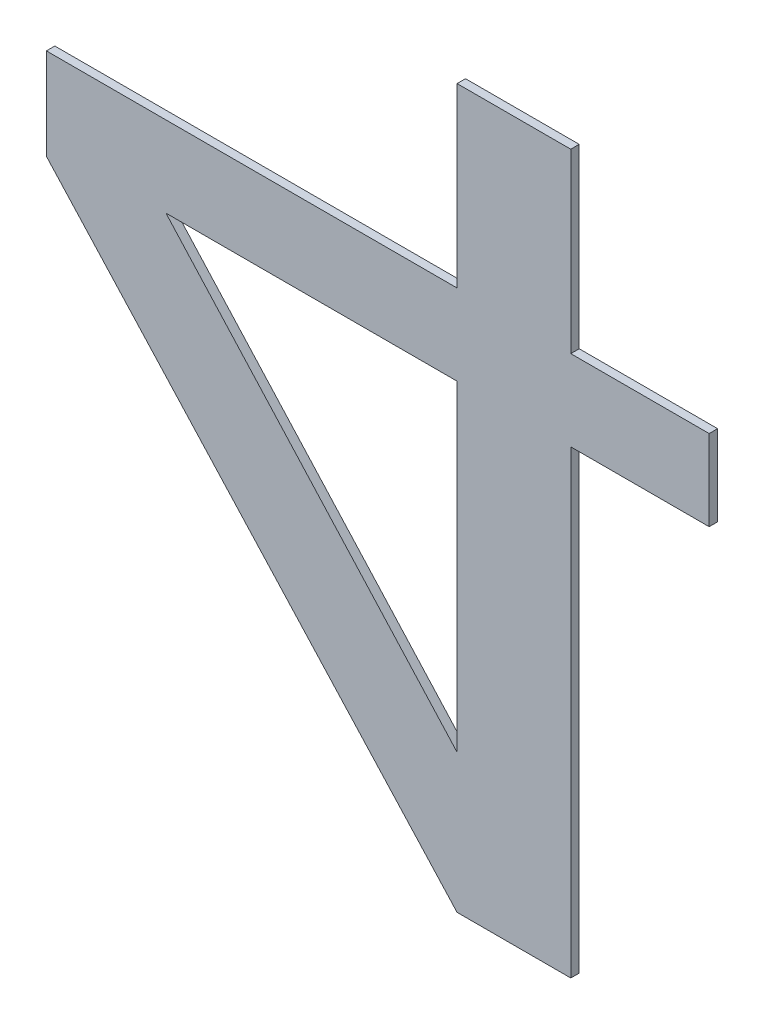
ISO-10303-21;
HEADER;
FILE_DESCRIPTION(('STEP AP214'),'2;1');
FILE_NAME('part.step','',(''),(''),'','','');
FILE_SCHEMA(('AUTOMOTIVE_DESIGN { 1 0 10303 214 1 1 1 1 }'));
ENDSEC;
DATA;
#1=APPLICATION_CONTEXT('core data for automotive mechanical design processes');
#2=APPLICATION_PROTOCOL_DEFINITION('international standard','automotive_design',2000,#1);
#3=PRODUCT_CONTEXT('',#1,'mechanical');
#4=PRODUCT('Part','Part','',(#3));
#5=PRODUCT_RELATED_PRODUCT_CATEGORY('part','',(#4));
#6=PRODUCT_DEFINITION_FORMATION('','',#4);
#7=PRODUCT_DEFINITION_CONTEXT('part definition',#1,'design');
#8=PRODUCT_DEFINITION('design','',#6,#7);
#9=PRODUCT_DEFINITION_SHAPE('','',#8);
#10=(LENGTH_UNIT() NAMED_UNIT(*) SI_UNIT(.MILLI.,.METRE.));
#11=(NAMED_UNIT(*) PLANE_ANGLE_UNIT() SI_UNIT($,.RADIAN.));
#12=(NAMED_UNIT(*) SI_UNIT($,.STERADIAN.) SOLID_ANGLE_UNIT());
#13=UNCERTAINTY_MEASURE_WITH_UNIT(LENGTH_MEASURE(1.E-05),#10,'distance_accuracy_value','');
#14=(GEOMETRIC_REPRESENTATION_CONTEXT(3) GLOBAL_UNCERTAINTY_ASSIGNED_CONTEXT((#13)) GLOBAL_UNIT_ASSIGNED_CONTEXT((#10,
#11,#12)) REPRESENTATION_CONTEXT('',''));
#15=CARTESIAN_POINT('',(0.,0.,0.));
#16=DIRECTION('',(0.,0.,1.));
#17=DIRECTION('',(1.,0.,0.));
#18=AXIS2_PLACEMENT_3D('',#15,#16,#17);
#19=CARTESIAN_POINT('',(-0.0269561142830154,0.0653781223592418,-3.5306));
#20=DIRECTION('',(0.,0.,1.));
#21=DIRECTION('',(1.,0.,0.));
#22=AXIS2_PLACEMENT_3D('',#19,#20,#21);
#23=PLANE('',#22);
#24=DIRECTION('',(1.,0.,0.));
#25=VECTOR('',#24,1.);
#26=CARTESIAN_POINT('',(-0.0768047949656172,0.14144017505025,-3.5306));
#27=LINE('',#26,#25);
#28=CARTESIAN_POINT('',(-0.186276473068739,0.141440175050248,-3.5306));
#29=VERTEX_POINT('',#28);
#30=CARTESIAN_POINT('',(0.0326668831375026,0.14144017505025,-3.5306));
#31=VERTEX_POINT('',#30);
#32=EDGE_CURVE('E186',#29,#31,#27,.T.);
#33=ORIENTED_EDGE('',*,*,#32,.T.);
#34=DIRECTION('',(0.,1.,0.));
#35=VECTOR('',#34,1.);
#36=CARTESIAN_POINT('',(0.0326668831375026,0.0206134295401527,-3.5306));
#37=LINE('',#36,#35);
#38=CARTESIAN_POINT('',(0.0326668831375032,-0.100213315969944,-3.5306));
#39=VERTEX_POINT('',#38);
#40=EDGE_CURVE('E179',#31,#39,#37,.F.);
#41=ORIENTED_EDGE('',*,*,#40,.T.);
#42=DIRECTION('',(-0.671426608920731,0.741071055185134,0.));
#43=VECTOR('',#42,1.);
#44=CARTESIAN_POINT('',(-0.0768047949656172,0.0206134295401476,-3.5306));
#45=LINE('',#44,#43);
#46=EDGE_CURVE('E183',#29,#39,#45,.F.);
#47=ORIENTED_EDGE('',*,*,#46,.F.);
#48=EDGE_LOOP('',(#33,#41,#47));
#49=FACE_BOUND('',#48,.T.);
#50=DIRECTION('',(0.,1.,0.));
#51=VECTOR('',#50,1.);
#52=CARTESIAN_POINT('',(0.222287374945519,0.171789124274023,-3.5306));
#53=LINE('',#52,#51);
#54=CARTESIAN_POINT('',(0.222287374945519,0.202138073497771,-3.5306));
#55=VERTEX_POINT('',#54);
#56=CARTESIAN_POINT('',(0.222287374945519,0.14144017505025,-3.5306));
#57=VERTEX_POINT('',#56);
#58=EDGE_CURVE('E117',#55,#57,#53,.F.);
#59=ORIENTED_EDGE('',*,*,#58,.F.);
#60=DIRECTION('',(1.,0.,0.));
#61=VECTOR('',#60,1.);
#62=CARTESIAN_POINT('',(0.170239496596196,0.202138073497771,-3.5306));
#63=LINE('',#62,#61);
#64=CARTESIAN_POINT('',(0.118191618246872,0.202138073497771,-3.5306));
#65=VERTEX_POINT('',#64);
#66=EDGE_CURVE('E18',#65,#55,#63,.T.);
#67=ORIENTED_EDGE('',*,*,#66,.F.);
#68=DIRECTION('',(0.,1.,0.));
#69=VECTOR('',#68,1.);
#70=CARTESIAN_POINT('',(0.118191618246872,0.268716077995014,-3.5306));
#71=LINE('',#70,#69);
#72=CARTESIAN_POINT('',(0.118191618246872,0.335294082492282,-3.5306));
#73=VERTEX_POINT('',#72);
#74=EDGE_CURVE('E113',#73,#65,#71,.F.);
#75=ORIENTED_EDGE('',*,*,#74,.F.);
#76=DIRECTION('',(1.,0.,0.));
#77=VECTOR('',#76,1.);
#78=CARTESIAN_POINT('',(0.0754292506921748,0.335294082492282,-3.5306));
#79=LINE('',#78,#77);
#80=CARTESIAN_POINT('',(0.0326668831375026,0.335294082492282,-3.5306));
#81=VERTEX_POINT('',#80);
#82=EDGE_CURVE('E135',#81,#73,#79,.T.);
#83=ORIENTED_EDGE('',*,*,#82,.F.);
#84=DIRECTION('',(0.,1.,0.));
#85=VECTOR('',#84,1.);
#86=CARTESIAN_POINT('',(0.0326668831375026,0.268716077995014,-3.5306));
#87=LINE('',#86,#85);
#88=CARTESIAN_POINT('',(0.0326668831375026,0.202138073497771,-3.5306));
#89=VERTEX_POINT('',#88);
#90=EDGE_CURVE('E137',#81,#89,#87,.F.);
#91=ORIENTED_EDGE('',*,*,#90,.T.);
#92=DIRECTION('',(1.,0.,0.));
#93=VECTOR('',#92,1.);
#94=CARTESIAN_POINT('',(-0.121766360187011,0.202138073497771,-3.5306));
#95=LINE('',#94,#93);
#96=CARTESIAN_POINT('',(-0.27619960351155,0.202138073497771,-3.5306));
#97=VERTEX_POINT('',#96);
#98=EDGE_CURVE('E144',#97,#89,#95,.T.);
#99=ORIENTED_EDGE('',*,*,#98,.F.);
#100=DIRECTION('',(0.,1.,0.));
#101=VECTOR('',#100,1.);
#102=CARTESIAN_POINT('',(-0.27619960351155,0.167805822866906,-3.5306));
#103=LINE('',#102,#101);
#104=CARTESIAN_POINT('',(-0.276199603511545,0.133473572236064,-3.5306));
#105=VERTEX_POINT('',#104);
#106=EDGE_CURVE('E147',#97,#105,#103,.F.);
#107=ORIENTED_EDGE('',*,*,#106,.T.);
#108=DIRECTION('',(-0.674563948422604,0.738216417785805,0.));
#109=VECTOR('',#108,1.);
#110=CARTESIAN_POINT('',(-0.121766360187011,-0.0355321327688664,-3.5306));
#111=LINE('',#110,#109);
#112=CARTESIAN_POINT('',(0.0326668831375038,-0.204537837773797,-3.5306));
#113=VERTEX_POINT('',#112);
#114=EDGE_CURVE('E153',#105,#113,#111,.F.);
#115=ORIENTED_EDGE('',*,*,#114,.T.);
#116=DIRECTION('',(1.,0.,0.));
#117=VECTOR('',#116,1.);
#118=CARTESIAN_POINT('',(0.0754292506921748,-0.204537837773798,-3.5306));
#119=LINE('',#118,#117);
#120=CARTESIAN_POINT('',(0.118191618246872,-0.204537837773798,-3.5306));
#121=VERTEX_POINT('',#120);
#122=EDGE_CURVE('E159',#113,#121,#119,.T.);
#123=ORIENTED_EDGE('',*,*,#122,.T.);
#124=DIRECTION('',(0.,1.,0.));
#125=VECTOR('',#124,1.);
#126=CARTESIAN_POINT('',(0.118191618246872,-0.0315488313617742,-3.5306));
#127=LINE('',#126,#125);
#128=CARTESIAN_POINT('',(0.118191618246872,0.14144017505025,-3.5306));
#129=VERTEX_POINT('',#128);
#130=EDGE_CURVE('E166',#129,#121,#127,.F.);
#131=ORIENTED_EDGE('',*,*,#130,.F.);
#132=DIRECTION('',(1.,0.,0.));
#133=VECTOR('',#132,1.);
#134=CARTESIAN_POINT('',(0.170239496596196,0.14144017505025,-3.5306));
#135=LINE('',#134,#133);
#136=EDGE_CURVE('E169',#129,#57,#135,.T.);
#137=ORIENTED_EDGE('',*,*,#136,.T.);
#138=EDGE_LOOP('',(#59,#67,#75,#83,#91,#99,#107,#115,#123,#131,#137));
#139=FACE_BOUND('',#138,.T.);
#140=ADVANCED_FACE('F15',(#49,#139),#23,.T.);
#141=CARTESIAN_POINT('',(0.170239496596196,0.202138073497771,-3.533775));
#142=DIRECTION('',(0.,1.,0.));
#143=DIRECTION('',(0.,0.,1.));
#144=AXIS2_PLACEMENT_3D('',#141,#142,#143);
#145=PLANE('',#144);
#146=DIRECTION('',(0.,0.,-1.));
#147=VECTOR('',#146,1.);
#148=CARTESIAN_POINT('',(0.118191618246872,0.202138073497771,-3.533775));
#149=LINE('',#148,#147);
#150=CARTESIAN_POINT('',(0.118191618246872,0.202138073497771,-3.53695));
#151=VERTEX_POINT('',#150);
#152=EDGE_CURVE('E122',#65,#151,#149,.T.);
#153=ORIENTED_EDGE('',*,*,#152,.F.);
#154=ORIENTED_EDGE('',*,*,#66,.T.);
#155=DIRECTION('',(0.,0.,-1.));
#156=VECTOR('',#155,1.);
#157=CARTESIAN_POINT('',(0.222287374945519,0.202138073497771,-3.533775));
#158=LINE('',#157,#156);
#159=CARTESIAN_POINT('',(0.222287374945519,0.202138073497771,-3.53695));
#160=VERTEX_POINT('',#159);
#161=EDGE_CURVE('E176',#160,#55,#158,.F.);
#162=ORIENTED_EDGE('',*,*,#161,.F.);
#163=DIRECTION('',(1.,0.,0.));
#164=VECTOR('',#163,1.);
#165=CARTESIAN_POINT('',(-0.0269561142830154,0.202138073497771,-3.53695));
#166=LINE('',#165,#164);
#167=EDGE_CURVE('E132',#160,#151,#166,.F.);
#168=ORIENTED_EDGE('',*,*,#167,.T.);
#169=EDGE_LOOP('',(#153,#154,#162,#168));
#170=FACE_BOUND('',#169,.T.);
#171=ADVANCED_FACE('F131',(#170),#145,.T.);
#172=CARTESIAN_POINT('',(0.118191618246872,0.268716077995014,-3.533775));
#173=DIRECTION('',(1.,0.,0.));
#174=DIRECTION('',(0.,0.,-1.));
#175=AXIS2_PLACEMENT_3D('',#172,#173,#174);
#176=PLANE('',#175);
#177=DIRECTION('',(0.,0.,1.));
#178=VECTOR('',#177,1.);
#179=CARTESIAN_POINT('',(0.118191618246872,0.335294082492282,-3.533775));
#180=LINE('',#179,#178);
#181=CARTESIAN_POINT('',(0.118191618246872,0.335294082492282,-3.53695));
#182=VERTEX_POINT('',#181);
#183=EDGE_CURVE('E128',#73,#182,#180,.F.);
#184=ORIENTED_EDGE('',*,*,#183,.F.);
#185=ORIENTED_EDGE('',*,*,#74,.T.);
#186=ORIENTED_EDGE('',*,*,#152,.T.);
#187=DIRECTION('',(0.,1.,0.));
#188=VECTOR('',#187,1.);
#189=CARTESIAN_POINT('',(0.118191618246872,0.0653781223592418,-3.53695));
#190=LINE('',#189,#188);
#191=EDGE_CURVE('E194',#151,#182,#190,.T.);
#192=ORIENTED_EDGE('',*,*,#191,.T.);
#193=EDGE_LOOP('',(#184,#185,#186,#192));
#194=FACE_BOUND('',#193,.T.);
#195=ADVANCED_FACE('F125',(#194),#176,.T.);
#196=CARTESIAN_POINT('',(0.0754292506921748,0.335294082492282,-3.533775));
#197=DIRECTION('',(0.,1.,0.));
#198=DIRECTION('',(0.,0.,1.));
#199=AXIS2_PLACEMENT_3D('',#196,#197,#198);
#200=PLANE('',#199);
#201=DIRECTION('',(0.,0.,-1.));
#202=VECTOR('',#201,1.);
#203=CARTESIAN_POINT('',(0.0326668831375026,0.335294082492282,-3.533775));
#204=LINE('',#203,#202);
#205=CARTESIAN_POINT('',(0.0326668831375026,0.335294082492282,-3.53695));
#206=VERTEX_POINT('',#205);
#207=EDGE_CURVE('E139',#206,#81,#204,.F.);
#208=ORIENTED_EDGE('',*,*,#207,.T.);
#209=ORIENTED_EDGE('',*,*,#82,.T.);
#210=ORIENTED_EDGE('',*,*,#183,.T.);
#211=DIRECTION('',(1.,0.,0.));
#212=VECTOR('',#211,1.);
#213=CARTESIAN_POINT('',(-0.0269561142830154,0.335294082492282,-3.53695));
#214=LINE('',#213,#212);
#215=EDGE_CURVE('E196',#182,#206,#214,.F.);
#216=ORIENTED_EDGE('',*,*,#215,.T.);
#217=EDGE_LOOP('',(#208,#209,#210,#216));
#218=FACE_BOUND('',#217,.T.);
#219=ADVANCED_FACE('F281',(#218),#200,.T.);
#220=CARTESIAN_POINT('',(0.0326668831375026,0.268716077995014,-3.533775));
#221=DIRECTION('',(1.,0.,0.));
#222=DIRECTION('',(0.,0.,-1.));
#223=AXIS2_PLACEMENT_3D('',#220,#221,#222);
#224=PLANE('',#223);
#225=DIRECTION('',(0.,1.,0.));
#226=VECTOR('',#225,1.);
#227=CARTESIAN_POINT('',(0.0326668831375026,0.0653781223592418,-3.53695));
#228=LINE('',#227,#226);
#229=CARTESIAN_POINT('',(0.0326668831375026,0.202138073497771,-3.53695));
#230=VERTEX_POINT('',#229);
#231=EDGE_CURVE('E199',#206,#230,#228,.F.);
#232=ORIENTED_EDGE('',*,*,#231,.T.);
#233=DIRECTION('',(0.,0.,1.));
#234=VECTOR('',#233,1.);
#235=CARTESIAN_POINT('',(0.0326668831375026,0.202138073497771,-3.533775));
#236=LINE('',#235,#234);
#237=EDGE_CURVE('E142',#89,#230,#236,.F.);
#238=ORIENTED_EDGE('',*,*,#237,.F.);
#239=ORIENTED_EDGE('',*,*,#90,.F.);
#240=ORIENTED_EDGE('',*,*,#207,.F.);
#241=EDGE_LOOP('',(#232,#238,#239,#240));
#242=FACE_BOUND('',#241,.T.);
#243=ADVANCED_FACE('F277',(#242),#224,.F.);
#244=CARTESIAN_POINT('',(-0.121766360187011,0.202138073497771,-3.533775));
#245=DIRECTION('',(0.,1.,0.));
#246=DIRECTION('',(0.,0.,1.));
#247=AXIS2_PLACEMENT_3D('',#244,#245,#246);
#248=PLANE('',#247);
#249=DIRECTION('',(0.,0.,-1.));
#250=VECTOR('',#249,1.);
#251=CARTESIAN_POINT('',(-0.27619960351155,0.202138073497771,-3.533775));
#252=LINE('',#251,#250);
#253=CARTESIAN_POINT('',(-0.27619960351155,0.202138073497771,-3.53695));
#254=VERTEX_POINT('',#253);
#255=EDGE_CURVE('E150',#254,#97,#252,.F.);
#256=ORIENTED_EDGE('',*,*,#255,.T.);
#257=ORIENTED_EDGE('',*,*,#98,.T.);
#258=ORIENTED_EDGE('',*,*,#237,.T.);
#259=DIRECTION('',(1.,0.,0.));
#260=VECTOR('',#259,1.);
#261=CARTESIAN_POINT('',(-0.0269561142830154,0.202138073497771,-3.53695));
#262=LINE('',#261,#260);
#263=EDGE_CURVE('E202',#230,#254,#262,.F.);
#264=ORIENTED_EDGE('',*,*,#263,.T.);
#265=EDGE_LOOP('',(#256,#257,#258,#264));
#266=FACE_BOUND('',#265,.T.);
#267=ADVANCED_FACE('F273',(#266),#248,.T.);
#268=CARTESIAN_POINT('',(-0.27619960351155,0.167805822866906,-3.533775));
#269=DIRECTION('',(1.,0.,0.));
#270=DIRECTION('',(0.,0.,-1.));
#271=AXIS2_PLACEMENT_3D('',#268,#269,#270);
#272=PLANE('',#271);
#273=DIRECTION('',(0.,1.,0.));
#274=VECTOR('',#273,1.);
#275=CARTESIAN_POINT('',(-0.27619960351155,0.0653781223592418,-3.53695));
#276=LINE('',#275,#274);
#277=CARTESIAN_POINT('',(-0.276199603511545,0.133473572236058,-3.53695));
#278=VERTEX_POINT('',#277);
#279=EDGE_CURVE('E205',#254,#278,#276,.F.);
#280=ORIENTED_EDGE('',*,*,#279,.T.);
#281=DIRECTION('',(0.,0.,1.));
#282=VECTOR('',#281,1.);
#283=CARTESIAN_POINT('',(-0.276199603511529,0.13347357223606,-3.533775));
#284=LINE('',#283,#282);
#285=EDGE_CURVE('E156',#278,#105,#284,.T.);
#286=ORIENTED_EDGE('',*,*,#285,.T.);
#287=ORIENTED_EDGE('',*,*,#106,.F.);
#288=ORIENTED_EDGE('',*,*,#255,.F.);
#289=EDGE_LOOP('',(#280,#286,#287,#288));
#290=FACE_BOUND('',#289,.T.);
#291=ADVANCED_FACE('F269',(#290),#272,.F.);
#292=CARTESIAN_POINT('',(-0.121766360187011,-0.0355321327688664,-3.533775));
#293=DIRECTION('',(0.738216417785805,0.674563948422604,0.));
#294=DIRECTION('',(-0.674563948422604,0.738216417785805,0.));
#295=AXIS2_PLACEMENT_3D('',#292,#293,#294);
#296=PLANE('',#295);
#297=DIRECTION('',(0.67456394842264,-0.738216417785772,0.));
#298=VECTOR('',#297,1.);
#299=CARTESIAN_POINT('',(-0.27619960351155,0.13347357223604,-3.53695));
#300=LINE('',#299,#298);
#301=CARTESIAN_POINT('',(0.0326668831375051,-0.204537837773796,-3.53695));
#302=VERTEX_POINT('',#301);
#303=EDGE_CURVE('E208',#278,#302,#300,.T.);
#304=ORIENTED_EDGE('',*,*,#303,.T.);
#305=DIRECTION('',(0.,0.,1.));
#306=VECTOR('',#305,1.);
#307=CARTESIAN_POINT('',(0.0326668831375026,-0.204537837773798,-3.533775));
#308=LINE('',#307,#306);
#309=EDGE_CURVE('E161',#302,#113,#308,.T.);
#310=ORIENTED_EDGE('',*,*,#309,.T.);
#311=ORIENTED_EDGE('',*,*,#114,.F.);
#312=ORIENTED_EDGE('',*,*,#285,.F.);
#313=EDGE_LOOP('',(#304,#310,#311,#312));
#314=FACE_BOUND('',#313,.T.);
#315=ADVANCED_FACE('F265',(#314),#296,.F.);
#316=CARTESIAN_POINT('',(0.0754292506921748,-0.204537837773798,-3.533775));
#317=DIRECTION('',(0.,1.,0.));
#318=DIRECTION('',(0.,0.,1.));
#319=AXIS2_PLACEMENT_3D('',#316,#317,#318);
#320=PLANE('',#319);
#321=DIRECTION('',(1.,0.,0.));
#322=VECTOR('',#321,1.);
#323=CARTESIAN_POINT('',(-0.0269561142830154,-0.204537837773798,-3.53695));
#324=LINE('',#323,#322);
#325=CARTESIAN_POINT('',(0.118191618246872,-0.204537837773798,-3.53695));
#326=VERTEX_POINT('',#325);
#327=EDGE_CURVE('E211',#302,#326,#324,.T.);
#328=ORIENTED_EDGE('',*,*,#327,.T.);
#329=DIRECTION('',(0.,0.,-1.));
#330=VECTOR('',#329,1.);
#331=CARTESIAN_POINT('',(0.118191618246872,-0.204537837773798,-3.533775));
#332=LINE('',#331,#330);
#333=EDGE_CURVE('E164',#121,#326,#332,.T.);
#334=ORIENTED_EDGE('',*,*,#333,.F.);
#335=ORIENTED_EDGE('',*,*,#122,.F.);
#336=ORIENTED_EDGE('',*,*,#309,.F.);
#337=EDGE_LOOP('',(#328,#334,#335,#336));
#338=FACE_BOUND('',#337,.T.);
#339=ADVANCED_FACE('F261',(#338),#320,.F.);
#340=CARTESIAN_POINT('',(0.118191618246872,-0.0315488313617742,-3.533775));
#341=DIRECTION('',(1.,0.,0.));
#342=DIRECTION('',(0.,0.,-1.));
#343=AXIS2_PLACEMENT_3D('',#340,#341,#342);
#344=PLANE('',#343);
#345=DIRECTION('',(0.,0.,1.));
#346=VECTOR('',#345,1.);
#347=CARTESIAN_POINT('',(0.118191618246872,0.14144017505025,-3.533775));
#348=LINE('',#347,#346);
#349=CARTESIAN_POINT('',(0.118191618246872,0.14144017505025,-3.53695));
#350=VERTEX_POINT('',#349);
#351=EDGE_CURVE('E171',#350,#129,#348,.T.);
#352=ORIENTED_EDGE('',*,*,#351,.T.);
#353=ORIENTED_EDGE('',*,*,#130,.T.);
#354=ORIENTED_EDGE('',*,*,#333,.T.);
#355=DIRECTION('',(0.,1.,0.));
#356=VECTOR('',#355,1.);
#357=CARTESIAN_POINT('',(0.118191618246872,0.0653781223592418,-3.53695));
#358=LINE('',#357,#356);
#359=EDGE_CURVE('E214',#326,#350,#358,.T.);
#360=ORIENTED_EDGE('',*,*,#359,.T.);
#361=EDGE_LOOP('',(#352,#353,#354,#360));
#362=FACE_BOUND('',#361,.T.);
#363=ADVANCED_FACE('F257',(#362),#344,.T.);
#364=CARTESIAN_POINT('',(0.170239496596196,0.14144017505025,-3.533775));
#365=DIRECTION('',(0.,1.,0.));
#366=DIRECTION('',(0.,0.,1.));
#367=AXIS2_PLACEMENT_3D('',#364,#365,#366);
#368=PLANE('',#367);
#369=DIRECTION('',(1.,0.,0.));
#370=VECTOR('',#369,1.);
#371=CARTESIAN_POINT('',(-0.0269561142830154,0.14144017505025,-3.53695));
#372=LINE('',#371,#370);
#373=CARTESIAN_POINT('',(0.222287374945519,0.14144017505025,-3.53695));
#374=VERTEX_POINT('',#373);
#375=EDGE_CURVE('E217',#350,#374,#372,.T.);
#376=ORIENTED_EDGE('',*,*,#375,.T.);
#377=DIRECTION('',(0.,0.,-1.));
#378=VECTOR('',#377,1.);
#379=CARTESIAN_POINT('',(0.222287374945519,0.14144017505025,-3.533775));
#380=LINE('',#379,#378);
#381=EDGE_CURVE('E174',#57,#374,#380,.T.);
#382=ORIENTED_EDGE('',*,*,#381,.F.);
#383=ORIENTED_EDGE('',*,*,#136,.F.);
#384=ORIENTED_EDGE('',*,*,#351,.F.);
#385=EDGE_LOOP('',(#376,#382,#383,#384));
#386=FACE_BOUND('',#385,.T.);
#387=ADVANCED_FACE('F253',(#386),#368,.F.);
#388=CARTESIAN_POINT('',(0.222287374945519,0.171789124274023,-3.533775));
#389=DIRECTION('',(1.,0.,0.));
#390=DIRECTION('',(0.,0.,-1.));
#391=AXIS2_PLACEMENT_3D('',#388,#389,#390);
#392=PLANE('',#391);
#393=ORIENTED_EDGE('',*,*,#161,.T.);
#394=ORIENTED_EDGE('',*,*,#58,.T.);
#395=ORIENTED_EDGE('',*,*,#381,.T.);
#396=DIRECTION('',(0.,1.,0.));
#397=VECTOR('',#396,1.);
#398=CARTESIAN_POINT('',(0.222287374945519,0.0653781223592418,-3.53695));
#399=LINE('',#398,#397);
#400=EDGE_CURVE('E220',#374,#160,#399,.T.);
#401=ORIENTED_EDGE('',*,*,#400,.T.);
#402=EDGE_LOOP('',(#393,#394,#395,#401));
#403=FACE_BOUND('',#402,.T.);
#404=ADVANCED_FACE('F250',(#403),#392,.T.);
#405=CARTESIAN_POINT('',(0.0326668831375026,0.0206134295401527,-3.533775));
#406=DIRECTION('',(1.,0.,0.));
#407=DIRECTION('',(0.,0.,-1.));
#408=AXIS2_PLACEMENT_3D('',#405,#406,#407);
#409=PLANE('',#408);
#410=DIRECTION('',(0.,1.,0.));
#411=VECTOR('',#410,1.);
#412=CARTESIAN_POINT('',(0.0326668831375026,0.0653781223592418,-3.53695));
#413=LINE('',#412,#411);
#414=CARTESIAN_POINT('',(0.0326668831375026,0.14144017505025,-3.53695));
#415=VERTEX_POINT('',#414);
#416=CARTESIAN_POINT('',(0.0326668831375032,-0.100213315969944,-3.53695));
#417=VERTEX_POINT('',#416);
#418=EDGE_CURVE('E223',#415,#417,#413,.F.);
#419=ORIENTED_EDGE('',*,*,#418,.T.);
#420=DIRECTION('',(0.,0.,1.));
#421=VECTOR('',#420,1.);
#422=CARTESIAN_POINT('',(0.0326668831375048,-0.100213315969943,-3.533775));
#423=LINE('',#422,#421);
#424=EDGE_CURVE('E181',#39,#417,#423,.F.);
#425=ORIENTED_EDGE('',*,*,#424,.F.);
#426=ORIENTED_EDGE('',*,*,#40,.F.);
#427=DIRECTION('',(0.,0.,1.));
#428=VECTOR('',#427,1.);
#429=CARTESIAN_POINT('',(0.0326668831375026,0.14144017505025,-3.533775));
#430=LINE('',#429,#428);
#431=EDGE_CURVE('E189',#31,#415,#430,.F.);
#432=ORIENTED_EDGE('',*,*,#431,.T.);
#433=EDGE_LOOP('',(#419,#425,#426,#432));
#434=FACE_BOUND('',#433,.T.);
#435=ADVANCED_FACE('F235',(#434),#409,.F.);
#436=CARTESIAN_POINT('',(-0.0768047949656172,0.0206134295401476,-3.533775));
#437=DIRECTION('',(0.741071055185134,0.671426608920731,0.));
#438=DIRECTION('',(-0.671426608920731,0.741071055185134,0.));
#439=AXIS2_PLACEMENT_3D('',#436,#437,#438);
#440=PLANE('',#439);
#441=DIRECTION('',(0.,0.,1.));
#442=VECTOR('',#441,1.);
#443=CARTESIAN_POINT('',(-0.186276473068737,0.14144017505025,-3.533775));
#444=LINE('',#443,#442);
#445=CARTESIAN_POINT('',(-0.186276473068741,0.141440175050247,-3.53695));
#446=VERTEX_POINT('',#445);
#447=EDGE_CURVE('E32',#446,#29,#444,.T.);
#448=ORIENTED_EDGE('',*,*,#447,.T.);
#449=ORIENTED_EDGE('',*,*,#46,.T.);
#450=ORIENTED_EDGE('',*,*,#424,.T.);
#451=DIRECTION('',(-0.671426608920701,0.741071055185161,0.));
#452=VECTOR('',#451,1.);
#453=CARTESIAN_POINT('',(0.0326668831375026,-0.100213315969945,-3.53695));
#454=LINE('',#453,#452);
#455=EDGE_CURVE('E24',#417,#446,#454,.T.);
#456=ORIENTED_EDGE('',*,*,#455,.T.);
#457=EDGE_LOOP('',(#448,#449,#450,#456));
#458=FACE_BOUND('',#457,.T.);
#459=ADVANCED_FACE('F229',(#458),#440,.T.);
#460=CARTESIAN_POINT('',(-0.0768047949656172,0.14144017505025,-3.533775));
#461=DIRECTION('',(0.,1.,0.));
#462=DIRECTION('',(0.,0.,1.));
#463=AXIS2_PLACEMENT_3D('',#460,#461,#462);
#464=PLANE('',#463);
#465=DIRECTION('',(1.,0.,0.));
#466=VECTOR('',#465,1.);
#467=CARTESIAN_POINT('',(-0.0269561142830154,0.14144017505025,-3.53695));
#468=LINE('',#467,#466);
#469=EDGE_CURVE('E10',#446,#415,#468,.T.);
#470=ORIENTED_EDGE('',*,*,#469,.T.);
#471=ORIENTED_EDGE('',*,*,#431,.F.);
#472=ORIENTED_EDGE('',*,*,#32,.F.);
#473=ORIENTED_EDGE('',*,*,#447,.F.);
#474=EDGE_LOOP('',(#470,#471,#472,#473));
#475=FACE_BOUND('',#474,.T.);
#476=ADVANCED_FACE('F237',(#475),#464,.F.);
#477=CARTESIAN_POINT('',(-0.0269561142830154,0.0653781223592418,-3.53695));
#478=DIRECTION('',(0.,0.,1.));
#479=DIRECTION('',(1.,0.,0.));
#480=AXIS2_PLACEMENT_3D('',#477,#478,#479);
#481=PLANE('',#480);
#482=ORIENTED_EDGE('',*,*,#455,.F.);
#483=ORIENTED_EDGE('',*,*,#418,.F.);
#484=ORIENTED_EDGE('',*,*,#469,.F.);
#485=EDGE_LOOP('',(#482,#483,#484));
#486=FACE_BOUND('',#485,.T.);
#487=ORIENTED_EDGE('',*,*,#375,.F.);
#488=ORIENTED_EDGE('',*,*,#359,.F.);
#489=ORIENTED_EDGE('',*,*,#327,.F.);
#490=ORIENTED_EDGE('',*,*,#303,.F.);
#491=ORIENTED_EDGE('',*,*,#279,.F.);
#492=ORIENTED_EDGE('',*,*,#263,.F.);
#493=ORIENTED_EDGE('',*,*,#231,.F.);
#494=ORIENTED_EDGE('',*,*,#215,.F.);
#495=ORIENTED_EDGE('',*,*,#191,.F.);
#496=ORIENTED_EDGE('',*,*,#167,.F.);
#497=ORIENTED_EDGE('',*,*,#400,.F.);
#498=EDGE_LOOP('',(#487,#488,#489,#490,#491,#492,#493,#494,#495,#496,#497));
#499=FACE_BOUND('',#498,.T.);
#500=ADVANCED_FACE('F232',(#486,#499),#481,.F.);
#501=CLOSED_SHELL('',(#140,#171,#195,#219,#243,#267,#291,#315,#339,#363,#387,#404,#435,#459,
#476,#500));
#502=MANIFOLD_SOLID_BREP('B1',#501);
#503=ADVANCED_BREP_SHAPE_REPRESENTATION('',(#18,#502),#14);
#504=SHAPE_DEFINITION_REPRESENTATION(#9,#503);
ENDSEC;
END-ISO-10303-21;
